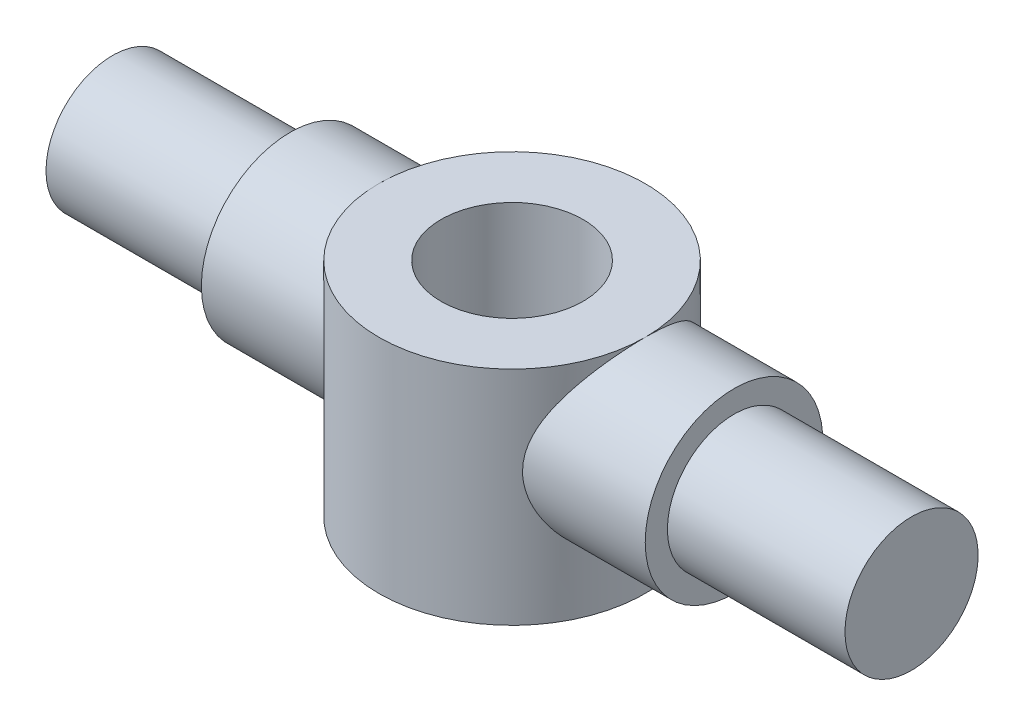
ISO-10303-21;
HEADER;
FILE_DESCRIPTION(('STEP AP214'),'2;1');
FILE_NAME('part.step','',(''),(''),'','','');
FILE_SCHEMA(('AUTOMOTIVE_DESIGN { 1 0 10303 214 1 1 1 1 }'));
ENDSEC;
DATA;
#1=APPLICATION_CONTEXT('core data for automotive mechanical design processes');
#2=APPLICATION_PROTOCOL_DEFINITION('international standard','automotive_design',2000,#1);
#3=PRODUCT_CONTEXT('',#1,'mechanical');
#4=PRODUCT('Part','Part','',(#3));
#5=PRODUCT_RELATED_PRODUCT_CATEGORY('part','',(#4));
#6=PRODUCT_DEFINITION_FORMATION('','',#4);
#7=PRODUCT_DEFINITION_CONTEXT('part definition',#1,'design');
#8=PRODUCT_DEFINITION('design','',#6,#7);
#9=PRODUCT_DEFINITION_SHAPE('','',#8);
#10=(LENGTH_UNIT() NAMED_UNIT(*) SI_UNIT(.MILLI.,.METRE.));
#11=(NAMED_UNIT(*) PLANE_ANGLE_UNIT() SI_UNIT($,.RADIAN.));
#12=(NAMED_UNIT(*) SI_UNIT($,.STERADIAN.) SOLID_ANGLE_UNIT());
#13=UNCERTAINTY_MEASURE_WITH_UNIT(LENGTH_MEASURE(1.E-05),#10,'distance_accuracy_value','');
#14=(GEOMETRIC_REPRESENTATION_CONTEXT(3) GLOBAL_UNCERTAINTY_ASSIGNED_CONTEXT((#13)) GLOBAL_UNIT_ASSIGNED_CONTEXT((#10,
#11,#12)) REPRESENTATION_CONTEXT('',''));
#15=CARTESIAN_POINT('',(0.,0.,0.));
#16=DIRECTION('',(0.,0.,1.));
#17=DIRECTION('',(1.,0.,0.));
#18=AXIS2_PLACEMENT_3D('',#15,#16,#17);
#19=CARTESIAN_POINT('',(0.,-3.,0.));
#20=DIRECTION('',(0.,1.,0.));
#21=DIRECTION('',(0.,0.,1.));
#22=AXIS2_PLACEMENT_3D('',#19,#20,#21);
#23=CYLINDRICAL_SURFACE('',#22,3.);
#24=CARTESIAN_POINT('',(0.,-3.,0.));
#25=DIRECTION('',(0.,1.,0.));
#26=DIRECTION('',(0.,0.,1.));
#27=AXIS2_PLACEMENT_3D('',#24,#25,#26);
#28=CIRCLE('',#27,3.);
#29=CARTESIAN_POINT('',(0.,-3.,3.));
#30=VERTEX_POINT('',#29);
#31=EDGE_CURVE('E108',#30,#30,#28,.T.);
#32=ORIENTED_EDGE('',*,*,#31,.T.);
#33=EDGE_LOOP('',(#32));
#34=FACE_BOUND('',#33,.T.);
#35=CARTESIAN_POINT('',(0.,2.,0.));
#36=DIRECTION('',(0.,1.,0.));
#37=DIRECTION('',(0.,0.,1.));
#38=AXIS2_PLACEMENT_3D('',#35,#36,#37);
#39=CIRCLE('',#38,3.);
#40=CARTESIAN_POINT('',(3.,2.,0.));
#41=VERTEX_POINT('',#40);
#42=CARTESIAN_POINT('',(-3.,2.,0.));
#43=VERTEX_POINT('',#42);
#44=EDGE_CURVE('E50',#41,#43,#39,.T.);
#45=ORIENTED_EDGE('',*,*,#44,.F.);
#46=CARTESIAN_POINT('',(2.23606797749979,0.,2.));
#47=CARTESIAN_POINT('',(2.23607753462817,0.0976283108686206,1.99999453997731));
#48=CARTESIAN_POINT('',(2.24258071047442,0.195290753708801,1.99278992503664));
#49=CARTESIAN_POINT('',(2.26731972501617,0.387119911650814,1.96458268317731));
#50=CARTESIAN_POINT('',(2.2855766081271,0.481280035529566,1.94355530587862));
#51=CARTESIAN_POINT('',(2.3305658582557,0.662735441877684,1.88935861676632));
#52=CARTESIAN_POINT('',(2.35721561794602,0.750087696737658,1.85630718014214));
#53=CARTESIAN_POINT('',(2.41584094681825,0.917865832346664,1.77934008393538));
#54=CARTESIAN_POINT('',(2.44781762158831,0.998290269976474,1.73542216812163));
#55=CARTESIAN_POINT('',(2.51946072932026,1.16364688761691,1.63002410007714));
#56=CARTESIAN_POINT('',(2.55954936090364,1.2473321177172,1.56687435451732));
#57=CARTESIAN_POINT('',(2.63944827308083,1.40400270887428,1.4281921974068));
#58=CARTESIAN_POINT('',(2.67925824297985,1.47697752165853,1.3526477317708));
#59=CARTESIAN_POINT('',(2.76088818523747,1.62064365878166,1.17815690494295));
#60=CARTESIAN_POINT('',(2.80216785846923,1.68948251177567,1.07740643965819));
#61=CARTESIAN_POINT('',(2.87558484482764,1.80864209549007,0.862470964212232));
#62=CARTESIAN_POINT('',(2.90773236231037,1.85898351403119,0.748301152321703));
#63=CARTESIAN_POINT('',(2.95599907464725,1.93355640101745,0.523249073480002));
#64=CARTESIAN_POINT('',(2.97351175615867,1.96008334449556,0.413434725181415));
#65=CARTESIAN_POINT('',(2.99609745461921,1.99418448928365,0.189695448729861));
#66=CARTESIAN_POINT('',(3.00118613762359,2.00178255922544,0.0757758812858244));
#67=CARTESIAN_POINT('',(2.99855361722953,1.99782755005095,-0.13414705023233));
#68=CARTESIAN_POINT('',(2.99266264910127,1.98901094868294,-0.230240638008753));
#69=CARTESIAN_POINT('',(2.9720818279002,1.95790894864109,-0.419238633271016));
#70=CARTESIAN_POINT('',(2.95739133313102,1.93562256769646,-0.512142807649724));
#71=CARTESIAN_POINT('',(2.92052091703736,1.87880431520542,-0.692077937671169));
#72=CARTESIAN_POINT('',(2.89837077982679,1.84432111480144,-0.779130623845961));
#73=CARTESIAN_POINT('',(2.84821104476287,1.76444635704718,-0.946209150653556));
#74=CARTESIAN_POINT('',(2.82020037745161,1.71905280849849,-1.0262337049694));
#75=CARTESIAN_POINT('',(2.75618058450702,1.61202126254011,-1.18828429196344));
#76=CARTESIAN_POINT('',(2.71960408792025,1.54903247664721,-1.26919148099708));
#77=CARTESIAN_POINT('',(2.64400601826998,1.41210132051968,-1.41998807498305));
#78=CARTESIAN_POINT('',(2.60498072815232,1.33814205406619,-1.48986013519457));
#79=CARTESIAN_POINT('',(2.52150044944152,1.16803678978671,-1.62772235326165));
#80=CARTESIAN_POINT('',(2.47714320008932,1.07022892028551,-1.69373593126354));
#81=CARTESIAN_POINT('',(2.39475610831095,0.862490160779287,-1.80834874945482));
#82=CARTESIAN_POINT('',(2.3567157153489,0.752580005586102,-1.85697718654898));
#83=CARTESIAN_POINT('',(2.30262870306889,0.555280937926897,-1.92332724567776));
#84=CARTESIAN_POINT('',(2.28340364577668,0.470406629943126,-1.94590791747533));
#85=CARTESIAN_POINT('',(2.25409039789612,0.296960510183162,-1.97979555580014));
#86=CARTESIAN_POINT('',(2.24398636782354,0.208395388827381,-1.99112206964395));
#87=CARTESIAN_POINT('',(2.23447556987372,0.0295570135585055,-2.00179400148877));
#88=CARTESIAN_POINT('',(2.2351153386647,-0.0607219785201236,-2.00108729753098));
#89=CARTESIAN_POINT('',(2.24709880368953,-0.239683833955044,-1.98761629716365));
#90=CARTESIAN_POINT('',(2.25845117648851,-0.328365344107385,-1.97484222690381));
#91=CARTESIAN_POINT('',(2.28927977500747,-0.497389417549839,-1.93899811187046));
#92=CARTESIAN_POINT('',(2.30833187069749,-0.577927709002577,-1.91646174529973));
#93=CARTESIAN_POINT('',(2.3522995853365,-0.734126236050298,-1.86223041628513));
#94=CARTESIAN_POINT('',(2.3772171729463,-0.809784822963013,-1.83053237805351));
#95=CARTESIAN_POINT('',(2.43611483596194,-0.97020200384752,-1.75163346599563));
#96=CARTESIAN_POINT('',(2.47091081434317,-1.05375681154269,-1.70260028818246));
#97=CARTESIAN_POINT('',(2.54262514806634,-1.21241680261729,-1.59352731501438));
#98=CARTESIAN_POINT('',(2.57954604947543,-1.28751151674245,-1.53347411883827));
#99=CARTESIAN_POINT('',(2.66075678321007,-1.44396234746754,-1.38876657712435));
#100=CARTESIAN_POINT('',(2.70489452138573,-1.52310284824832,-1.30160386514207));
#101=CARTESIAN_POINT('',(2.78775581841638,-1.66581668294029,-1.11309948866219));
#102=CARTESIAN_POINT('',(2.82648414789457,-1.72940377125673,-1.011770477457));
#103=CARTESIAN_POINT('',(2.88790821242222,-1.82789173891759,-0.817487474821796));
#104=CARTESIAN_POINT('',(2.91225458111008,-1.86595650444037,-0.72666236488632));
#105=CARTESIAN_POINT('',(2.95278707867041,-1.92860719432044,-0.538757079020514));
#106=CARTESIAN_POINT('',(2.96898009871993,-1.95320450285977,-0.441682263858768));
#107=CARTESIAN_POINT('',(2.99178364026746,-1.98769696383875,-0.243369392303442));
#108=CARTESIAN_POINT('',(2.99835150856533,-1.99752667950668,-0.142114836924317));
#109=CARTESIAN_POINT('',(3.00109821029056,-2.0016478514171,0.0608555465807331));
#110=CARTESIAN_POINT('',(2.99727800938902,-1.99594075195618,0.162571330953449));
#111=CARTESIAN_POINT('',(2.98029555977324,-1.9703405109953,0.355757532528107));
#112=CARTESIAN_POINT('',(2.96783277209856,-1.95150901513819,0.447435143070531));
#113=CARTESIAN_POINT('',(2.93536106206933,-1.9017619905691,0.626018422997062));
#114=CARTESIAN_POINT('',(2.91535096747103,-1.87084458465274,0.712923348686891));
#115=CARTESIAN_POINT('',(2.86791765486194,-1.79606129511597,0.885147296608352));
#116=CARTESIAN_POINT('',(2.84013248946338,-1.75154969250492,0.970083589200266));
#117=CARTESIAN_POINT('',(2.77975408235472,-1.65184935537401,1.13155266268318));
#118=CARTESIAN_POINT('',(2.74715796645263,-1.596654232048,1.20808037205002));
#119=CARTESIAN_POINT('',(2.67392931472394,-1.46737109766369,1.36329422201402));
#120=CARTESIAN_POINT('',(2.6328391387737,-1.39167697632596,1.44042679526091));
#121=CARTESIAN_POINT('',(2.55053357649486,-1.22888645845416,1.58160022281596));
#122=CARTESIAN_POINT('',(2.50931811970154,-1.14178161116591,1.64563128323923));
#123=CARTESIAN_POINT('',(2.43384213590298,-0.964132409244706,1.75513253518411));
#124=CARTESIAN_POINT('',(2.39929086741904,-0.874358190049655,1.8016464689721));
#125=CARTESIAN_POINT('',(2.33747501591023,-0.686715551006839,1.88115802340272));
#126=CARTESIAN_POINT('',(2.31019631295305,-0.588863306137845,1.91418190281333));
#127=CARTESIAN_POINT('',(2.27191051929539,-0.40922853157545,1.95936262470908));
#128=CARTESIAN_POINT('',(2.25863695410151,-0.328691763209701,1.97452228373248));
#129=CARTESIAN_POINT('',(2.24071519216009,-0.165443599495462,1.99483915818926));
#130=CARTESIAN_POINT('',(2.23605987841475,-0.0827340557394216,2.00000462703715));
#131=CARTESIAN_POINT('',(2.23606797749979,0.,2.));
#132=B_SPLINE_CURVE_WITH_KNOTS('',3,(#46,#47,#48,#49,#50,#51,#52,#53,#54,#55,#56,#57,#58,#59,
#60,#61,#62,#63,#64,#65,#66,#67,#68,#69,#70,#71,#72,#73,#74,#75,#76,#77,#78,#79,#80,#81,#82,#83,
#84,#85,#86,#87,#88,#89,#90,#91,#92,#93,#94,#95,#96,#97,#98,#99,#100,#101,#102,#103,#104,#105,
#106,#107,#108,#109,#110,#111,#112,#113,#114,#115,#116,#117,#118,#119,#120,#121,#122,#123,#124,
#125,#126,#127,#128,#129,#130,#131),.UNSPECIFIED.,.T.,.F.,(4,2,2,2,2,2,2,2,2,2,2,2,2,2,2,2,2,2,
2,2,2,2,2,2,2,2,2,2,2,2,2,2,2,2,2,2,2,2,2,2,2,2,4),(0.,0.292506930722153,0.585539042259288,
0.875772651216274,1.16606657266549,1.50154677068638,1.83735518436275,2.22167031006289,
2.6055542938858,2.9463748206358,3.28676536688298,3.57539534955742,3.86404638283746,
4.15155831973191,4.43912276903,4.76447525946635,5.09033414796638,5.46678703504944,
5.84260469743948,6.11126090401324,6.37944966235486,6.64880037638036,6.91836943570598,
7.17476451706936,7.43124577644957,7.73899230052352,8.04711556801509,8.42254684520963,
8.7976449057258,9.10070580611698,9.40351012888472,9.70765229266165,10.0117661844615,
10.2937678224973,10.5758132789284,10.874178629859,11.1727229593109,11.5182220628451,
11.863978504186,12.1833412579672,12.5020793664923,12.7501661630426,12.9980479966543),.UNSPECIFIED.);
#133=EDGE_CURVE('E55',#41,#41,#132,.T.);
#134=ORIENTED_EDGE('',*,*,#133,.T.);
#135=EDGE_CURVE('E62',#43,#41,#39,.T.);
#136=ORIENTED_EDGE('',*,*,#135,.F.);
#137=CARTESIAN_POINT('',(-2.23606797749979,0.,2.));
#138=CARTESIAN_POINT('',(-2.23607753462817,-0.0976283108686206,1.99999453997731));
#139=CARTESIAN_POINT('',(-2.24258071047442,-0.195290753708801,1.99278992503664));
#140=CARTESIAN_POINT('',(-2.26731972501617,-0.387119911650814,1.96458268317731));
#141=CARTESIAN_POINT('',(-2.2855766081271,-0.481280035529566,1.94355530587862));
#142=CARTESIAN_POINT('',(-2.3305658582557,-0.662735441877684,1.88935861676632));
#143=CARTESIAN_POINT('',(-2.35721561794602,-0.750087696737658,1.85630718014214));
#144=CARTESIAN_POINT('',(-2.41584094681825,-0.917865832346664,1.77934008393538));
#145=CARTESIAN_POINT('',(-2.44781762158831,-0.998290269976474,1.73542216812163));
#146=CARTESIAN_POINT('',(-2.51946072932026,-1.16364688761691,1.63002410007714));
#147=CARTESIAN_POINT('',(-2.55954936090364,-1.2473321177172,1.56687435451732));
#148=CARTESIAN_POINT('',(-2.63944827308083,-1.40400270887428,1.4281921974068));
#149=CARTESIAN_POINT('',(-2.67925824297985,-1.47697752165853,1.3526477317708));
#150=CARTESIAN_POINT('',(-2.76088818523747,-1.62064365878166,1.17815690494295));
#151=CARTESIAN_POINT('',(-2.80216785846923,-1.68948251177567,1.07740643965819));
#152=CARTESIAN_POINT('',(-2.87558484482764,-1.80864209549007,0.862470964212232));
#153=CARTESIAN_POINT('',(-2.90773236231037,-1.85898351403119,0.748301152321703));
#154=CARTESIAN_POINT('',(-2.95599907464725,-1.93355640101745,0.523249073480002));
#155=CARTESIAN_POINT('',(-2.97351175615867,-1.96008334449556,0.413434725181415));
#156=CARTESIAN_POINT('',(-2.99609745461921,-1.99418448928365,0.189695448729861));
#157=CARTESIAN_POINT('',(-3.00118613762359,-2.00178255922544,0.0757758812858244));
#158=CARTESIAN_POINT('',(-2.99855361722953,-1.99782755005095,-0.13414705023233));
#159=CARTESIAN_POINT('',(-2.99266264910127,-1.98901094868294,-0.230240638008753));
#160=CARTESIAN_POINT('',(-2.9720818279002,-1.95790894864109,-0.419238633271016));
#161=CARTESIAN_POINT('',(-2.95739133313102,-1.93562256769646,-0.512142807649724));
#162=CARTESIAN_POINT('',(-2.92052091703736,-1.87880431520542,-0.692077937671169));
#163=CARTESIAN_POINT('',(-2.89837077982679,-1.84432111480144,-0.779130623845961));
#164=CARTESIAN_POINT('',(-2.84821104476287,-1.76444635704718,-0.946209150653556));
#165=CARTESIAN_POINT('',(-2.82020037745161,-1.71905280849849,-1.0262337049694));
#166=CARTESIAN_POINT('',(-2.75618058450702,-1.61202126254011,-1.18828429196344));
#167=CARTESIAN_POINT('',(-2.71960408792025,-1.54903247664721,-1.26919148099708));
#168=CARTESIAN_POINT('',(-2.64400601826998,-1.41210132051968,-1.41998807498305));
#169=CARTESIAN_POINT('',(-2.60498072815232,-1.33814205406619,-1.48986013519457));
#170=CARTESIAN_POINT('',(-2.52150044944152,-1.16803678978671,-1.62772235326165));
#171=CARTESIAN_POINT('',(-2.47714320008932,-1.07022892028551,-1.69373593126354));
#172=CARTESIAN_POINT('',(-2.39475610831095,-0.862490160779287,-1.80834874945482));
#173=CARTESIAN_POINT('',(-2.3567157153489,-0.752580005586102,-1.85697718654898));
#174=CARTESIAN_POINT('',(-2.30262870306889,-0.555280937926897,-1.92332724567776));
#175=CARTESIAN_POINT('',(-2.28340364577668,-0.470406629943126,-1.94590791747533));
#176=CARTESIAN_POINT('',(-2.25409039789612,-0.296960510183162,-1.97979555580014));
#177=CARTESIAN_POINT('',(-2.24398636782354,-0.208395388827381,-1.99112206964395));
#178=CARTESIAN_POINT('',(-2.23447556987372,-0.0295570135585055,-2.00179400148877));
#179=CARTESIAN_POINT('',(-2.2351153386647,0.0607219785201236,-2.00108729753098));
#180=CARTESIAN_POINT('',(-2.24709880368953,0.239683833955044,-1.98761629716365));
#181=CARTESIAN_POINT('',(-2.25845117648851,0.328365344107385,-1.97484222690381));
#182=CARTESIAN_POINT('',(-2.28927977500747,0.497389417549839,-1.93899811187046));
#183=CARTESIAN_POINT('',(-2.30833187069749,0.577927709002577,-1.91646174529973));
#184=CARTESIAN_POINT('',(-2.3522995853365,0.734126236050298,-1.86223041628513));
#185=CARTESIAN_POINT('',(-2.3772171729463,0.809784822963013,-1.83053237805351));
#186=CARTESIAN_POINT('',(-2.43611483596194,0.97020200384752,-1.75163346599563));
#187=CARTESIAN_POINT('',(-2.47091081434317,1.05375681154269,-1.70260028818246));
#188=CARTESIAN_POINT('',(-2.54262514806634,1.21241680261729,-1.59352731501438));
#189=CARTESIAN_POINT('',(-2.57954604947543,1.28751151674245,-1.53347411883827));
#190=CARTESIAN_POINT('',(-2.66075678321007,1.44396234746754,-1.38876657712435));
#191=CARTESIAN_POINT('',(-2.70489452138573,1.52310284824832,-1.30160386514207));
#192=CARTESIAN_POINT('',(-2.78775581841638,1.66581668294029,-1.11309948866219));
#193=CARTESIAN_POINT('',(-2.82648414789457,1.72940377125673,-1.011770477457));
#194=CARTESIAN_POINT('',(-2.88790821242222,1.82789173891759,-0.817487474821796));
#195=CARTESIAN_POINT('',(-2.91225458111008,1.86595650444037,-0.72666236488632));
#196=CARTESIAN_POINT('',(-2.95278707867041,1.92860719432044,-0.538757079020514));
#197=CARTESIAN_POINT('',(-2.96898009871993,1.95320450285977,-0.441682263858768));
#198=CARTESIAN_POINT('',(-2.99178364026746,1.98769696383875,-0.243369392303442));
#199=CARTESIAN_POINT('',(-2.99835150856533,1.99752667950668,-0.142114836924317));
#200=CARTESIAN_POINT('',(-3.00109821029056,2.0016478514171,0.0608555465807331));
#201=CARTESIAN_POINT('',(-2.99727800938902,1.99594075195618,0.162571330953449));
#202=CARTESIAN_POINT('',(-2.98029555977324,1.9703405109953,0.355757532528107));
#203=CARTESIAN_POINT('',(-2.96783277209856,1.95150901513819,0.447435143070531));
#204=CARTESIAN_POINT('',(-2.93536106206933,1.9017619905691,0.626018422997062));
#205=CARTESIAN_POINT('',(-2.91535096747103,1.87084458465274,0.712923348686891));
#206=CARTESIAN_POINT('',(-2.86791765486194,1.79606129511597,0.885147296608352));
#207=CARTESIAN_POINT('',(-2.84013248946338,1.75154969250492,0.970083589200266));
#208=CARTESIAN_POINT('',(-2.77975408235472,1.65184935537401,1.13155266268318));
#209=CARTESIAN_POINT('',(-2.74715796645263,1.596654232048,1.20808037205002));
#210=CARTESIAN_POINT('',(-2.67392931472394,1.46737109766369,1.36329422201402));
#211=CARTESIAN_POINT('',(-2.6328391387737,1.39167697632596,1.44042679526091));
#212=CARTESIAN_POINT('',(-2.55053357649486,1.22888645845416,1.58160022281596));
#213=CARTESIAN_POINT('',(-2.50931811970154,1.14178161116591,1.64563128323923));
#214=CARTESIAN_POINT('',(-2.43384213590298,0.964132409244706,1.75513253518411));
#215=CARTESIAN_POINT('',(-2.39929086741904,0.874358190049655,1.8016464689721));
#216=CARTESIAN_POINT('',(-2.33747501591023,0.686715551006839,1.88115802340272));
#217=CARTESIAN_POINT('',(-2.31019631295305,0.588863306137845,1.91418190281333));
#218=CARTESIAN_POINT('',(-2.27191051929539,0.40922853157545,1.95936262470908));
#219=CARTESIAN_POINT('',(-2.25863695410151,0.328691763209701,1.97452228373248));
#220=CARTESIAN_POINT('',(-2.24071519216009,0.165443599495462,1.99483915818926));
#221=CARTESIAN_POINT('',(-2.23605987841475,0.0827340557394216,2.00000462703715));
#222=CARTESIAN_POINT('',(-2.23606797749979,0.,2.));
#223=B_SPLINE_CURVE_WITH_KNOTS('',3,(#137,#138,#139,#140,#141,#142,#143,#144,#145,#146,#147,
#148,#149,#150,#151,#152,#153,#154,#155,#156,#157,#158,#159,#160,#161,#162,#163,#164,#165,#166,
#167,#168,#169,#170,#171,#172,#173,#174,#175,#176,#177,#178,#179,#180,#181,#182,#183,#184,#185,
#186,#187,#188,#189,#190,#191,#192,#193,#194,#195,#196,#197,#198,#199,#200,#201,#202,#203,#204,
#205,#206,#207,#208,#209,#210,#211,#212,#213,#214,#215,#216,#217,#218,#219,#220,#221,#222),
.UNSPECIFIED.,.T.,.F.,(4,2,2,2,2,2,2,2,2,2,2,2,2,2,2,2,2,2,2,2,2,2,2,2,2,2,2,2,2,2,2,2,2,2,2,2,
2,2,2,2,2,2,4),(0.,0.292506930722153,0.585539042259288,0.875772651216274,1.16606657266549,
1.50154677068638,1.83735518436275,2.22167031006289,2.6055542938858,2.9463748206358,
3.28676536688298,3.57539534955742,3.86404638283746,4.15155831973191,4.43912276903,
4.76447525946635,5.09033414796638,5.46678703504944,5.84260469743948,6.11126090401324,
6.37944966235486,6.64880037638036,6.91836943570598,7.17476451706936,7.43124577644957,
7.73899230052352,8.04711556801509,8.42254684520963,8.7976449057258,9.10070580611698,
9.40351012888472,9.70765229266165,10.0117661844615,10.2937678224973,10.5758132789284,
10.874178629859,11.1727229593109,11.5182220628451,11.863978504186,12.1833412579672,
12.5020793664923,12.7501661630426,12.9980479966543),.UNSPECIFIED.);
#224=EDGE_CURVE('E110',#43,#43,#223,.T.);
#225=ORIENTED_EDGE('',*,*,#224,.T.);
#226=EDGE_LOOP('',(#45,#134,#136,#225));
#227=FACE_BOUND('',#226,.T.);
#228=ADVANCED_FACE('F35',(#34,#227),#23,.T.);
#229=CARTESIAN_POINT('',(-9.,0.,0.));
#230=DIRECTION('',(-1.,0.,0.));
#231=DIRECTION('',(0.,0.,1.));
#232=AXIS2_PLACEMENT_3D('',#229,#230,#231);
#233=CYLINDRICAL_SURFACE('',#232,2.);
#234=ORIENTED_EDGE('',*,*,#224,.F.);
#235=EDGE_LOOP('',(#234));
#236=FACE_BOUND('',#235,.T.);
#237=CARTESIAN_POINT('',(-5.,0.,0.));
#238=DIRECTION('',(-1.,0.,0.));
#239=DIRECTION('',(0.,0.,1.));
#240=AXIS2_PLACEMENT_3D('',#237,#238,#239);
#241=CIRCLE('',#240,2.);
#242=CARTESIAN_POINT('',(-5.,0.,2.));
#243=VERTEX_POINT('',#242);
#244=EDGE_CURVE('E123',#243,#243,#241,.T.);
#245=ORIENTED_EDGE('',*,*,#244,.F.);
#246=EDGE_LOOP('',(#245));
#247=FACE_BOUND('',#246,.T.);
#248=ADVANCED_FACE('F37',(#236,#247),#233,.T.);
#249=CARTESIAN_POINT('',(-9.,0.,1.));
#250=DIRECTION('',(1.,0.,0.));
#251=DIRECTION('',(0.,0.,-1.));
#252=AXIS2_PLACEMENT_3D('',#249,#250,#251);
#253=PLANE('',#252);
#254=CARTESIAN_POINT('',(-9.,0.,0.));
#255=DIRECTION('',(-1.,0.,0.));
#256=DIRECTION('',(0.,0.,1.));
#257=AXIS2_PLACEMENT_3D('',#254,#255,#256);
#258=CIRCLE('',#257,1.5);
#259=CARTESIAN_POINT('',(-9.,0.,1.5));
#260=VERTEX_POINT('',#259);
#261=EDGE_CURVE('E11',#260,#260,#258,.T.);
#262=ORIENTED_EDGE('',*,*,#261,.T.);
#263=EDGE_LOOP('',(#262));
#264=FACE_BOUND('',#263,.T.);
#265=ADVANCED_FACE('F104',(#264),#253,.F.);
#266=CARTESIAN_POINT('',(-9.,0.,0.));
#267=DIRECTION('',(-1.,0.,0.));
#268=DIRECTION('',(0.,0.,1.));
#269=AXIS2_PLACEMENT_3D('',#266,#267,#268);
#270=CYLINDRICAL_SURFACE('',#269,1.5);
#271=CARTESIAN_POINT('',(-5.,0.,0.));
#272=DIRECTION('',(-1.,0.,0.));
#273=DIRECTION('',(0.,0.,1.));
#274=AXIS2_PLACEMENT_3D('',#271,#272,#273);
#275=CIRCLE('',#274,1.5);
#276=CARTESIAN_POINT('',(-5.,0.,1.5));
#277=VERTEX_POINT('',#276);
#278=EDGE_CURVE('E44',#277,#277,#275,.T.);
#279=ORIENTED_EDGE('',*,*,#278,.T.);
#280=EDGE_LOOP('',(#279));
#281=FACE_BOUND('',#280,.T.);
#282=ORIENTED_EDGE('',*,*,#261,.F.);
#283=EDGE_LOOP('',(#282));
#284=FACE_BOUND('',#283,.T.);
#285=ADVANCED_FACE('F95',(#281,#284),#270,.T.);
#286=CARTESIAN_POINT('',(-5.,0.,1.));
#287=DIRECTION('',(1.,0.,0.));
#288=DIRECTION('',(0.,0.,-1.));
#289=AXIS2_PLACEMENT_3D('',#286,#287,#288);
#290=PLANE('',#289);
#291=ORIENTED_EDGE('',*,*,#278,.F.);
#292=EDGE_LOOP('',(#291));
#293=FACE_BOUND('',#292,.T.);
#294=ORIENTED_EDGE('',*,*,#244,.T.);
#295=EDGE_LOOP('',(#294));
#296=FACE_BOUND('',#295,.T.);
#297=ADVANCED_FACE('F90',(#293,#296),#290,.F.);
#298=CARTESIAN_POINT('',(0.,-3.,0.));
#299=DIRECTION('',(0.,1.,0.));
#300=DIRECTION('',(0.,0.,1.));
#301=AXIS2_PLACEMENT_3D('',#298,#299,#300);
#302=CYLINDRICAL_SURFACE('',#301,1.6);
#303=CARTESIAN_POINT('',(0.,-3.,0.));
#304=DIRECTION('',(0.,1.,0.));
#305=DIRECTION('',(0.,0.,1.));
#306=AXIS2_PLACEMENT_3D('',#303,#304,#305);
#307=CIRCLE('',#306,1.6);
#308=CARTESIAN_POINT('',(0.,-3.,1.6));
#309=VERTEX_POINT('',#308);
#310=EDGE_CURVE('E115',#309,#309,#307,.T.);
#311=ORIENTED_EDGE('',*,*,#310,.F.);
#312=EDGE_LOOP('',(#311));
#313=FACE_BOUND('',#312,.T.);
#314=CARTESIAN_POINT('',(0.,2.,0.));
#315=DIRECTION('',(0.,1.,0.));
#316=DIRECTION('',(0.,0.,1.));
#317=AXIS2_PLACEMENT_3D('',#314,#315,#316);
#318=CIRCLE('',#317,1.6);
#319=CARTESIAN_POINT('',(0.,2.,1.6));
#320=VERTEX_POINT('',#319);
#321=EDGE_CURVE('E112',#320,#320,#318,.T.);
#322=ORIENTED_EDGE('',*,*,#321,.T.);
#323=EDGE_LOOP('',(#322));
#324=FACE_BOUND('',#323,.T.);
#325=ADVANCED_FACE('F87',(#313,#324),#302,.F.);
#326=CARTESIAN_POINT('',(-14.2282946785896,-3.,1.));
#327=DIRECTION('',(0.,1.,0.));
#328=DIRECTION('',(0.,0.,1.));
#329=AXIS2_PLACEMENT_3D('',#326,#327,#328);
#330=PLANE('',#329);
#331=ORIENTED_EDGE('',*,*,#31,.F.);
#332=EDGE_LOOP('',(#331));
#333=FACE_BOUND('',#332,.T.);
#334=ORIENTED_EDGE('',*,*,#310,.T.);
#335=EDGE_LOOP('',(#334));
#336=FACE_BOUND('',#335,.T.);
#337=ADVANCED_FACE('F85',(#333,#336),#330,.F.);
#338=CARTESIAN_POINT('',(-14.2282946785896,2.,1.));
#339=DIRECTION('',(0.,1.,0.));
#340=DIRECTION('',(0.,0.,1.));
#341=AXIS2_PLACEMENT_3D('',#338,#339,#340);
#342=PLANE('',#341);
#343=ORIENTED_EDGE('',*,*,#135,.T.);
#344=ORIENTED_EDGE('',*,*,#44,.T.);
#345=EDGE_LOOP('',(#343,#344));
#346=FACE_BOUND('',#345,.T.);
#347=ORIENTED_EDGE('',*,*,#321,.F.);
#348=EDGE_LOOP('',(#347));
#349=FACE_BOUND('',#348,.T.);
#350=ADVANCED_FACE('F81',(#346,#349),#342,.T.);
#351=CARTESIAN_POINT('',(-9.,0.,0.));
#352=DIRECTION('',(-1.,0.,0.));
#353=DIRECTION('',(0.,0.,1.));
#354=AXIS2_PLACEMENT_3D('',#351,#352,#353);
#355=CYLINDRICAL_SURFACE('',#354,2.);
#356=ORIENTED_EDGE('',*,*,#133,.F.);
#357=EDGE_LOOP('',(#356));
#358=FACE_BOUND('',#357,.T.);
#359=CARTESIAN_POINT('',(5.,0.,0.));
#360=DIRECTION('',(-1.,0.,0.));
#361=DIRECTION('',(0.,0.,1.));
#362=AXIS2_PLACEMENT_3D('',#359,#360,#361);
#363=CIRCLE('',#362,2.);
#364=CARTESIAN_POINT('',(5.,0.,2.));
#365=VERTEX_POINT('',#364);
#366=EDGE_CURVE('E60',#365,#365,#363,.T.);
#367=ORIENTED_EDGE('',*,*,#366,.T.);
#368=EDGE_LOOP('',(#367));
#369=FACE_BOUND('',#368,.T.);
#370=ADVANCED_FACE('F56',(#358,#369),#355,.T.);
#371=CARTESIAN_POINT('',(5.,0.,1.));
#372=DIRECTION('',(1.,0.,0.));
#373=DIRECTION('',(0.,0.,-1.));
#374=AXIS2_PLACEMENT_3D('',#371,#372,#373);
#375=PLANE('',#374);
#376=CARTESIAN_POINT('',(5.,0.,0.));
#377=DIRECTION('',(-1.,0.,0.));
#378=DIRECTION('',(0.,0.,1.));
#379=AXIS2_PLACEMENT_3D('',#376,#377,#378);
#380=CIRCLE('',#379,1.5);
#381=CARTESIAN_POINT('',(5.,0.,1.5));
#382=VERTEX_POINT('',#381);
#383=EDGE_CURVE('E65',#382,#382,#380,.T.);
#384=ORIENTED_EDGE('',*,*,#383,.T.);
#385=EDGE_LOOP('',(#384));
#386=FACE_BOUND('',#385,.T.);
#387=ORIENTED_EDGE('',*,*,#366,.F.);
#388=EDGE_LOOP('',(#387));
#389=FACE_BOUND('',#388,.T.);
#390=ADVANCED_FACE('F80',(#386,#389),#375,.T.);
#391=CARTESIAN_POINT('',(-9.,0.,0.));
#392=DIRECTION('',(-1.,0.,0.));
#393=DIRECTION('',(0.,0.,1.));
#394=AXIS2_PLACEMENT_3D('',#391,#392,#393);
#395=CYLINDRICAL_SURFACE('',#394,1.5);
#396=ORIENTED_EDGE('',*,*,#383,.F.);
#397=EDGE_LOOP('',(#396));
#398=FACE_BOUND('',#397,.T.);
#399=CARTESIAN_POINT('',(9.,0.,0.));
#400=DIRECTION('',(-1.,0.,0.));
#401=DIRECTION('',(0.,0.,1.));
#402=AXIS2_PLACEMENT_3D('',#399,#400,#401);
#403=CIRCLE('',#402,1.5);
#404=CARTESIAN_POINT('',(9.,0.,1.5));
#405=VERTEX_POINT('',#404);
#406=EDGE_CURVE('E222',#405,#405,#403,.T.);
#407=ORIENTED_EDGE('',*,*,#406,.T.);
#408=EDGE_LOOP('',(#407));
#409=FACE_BOUND('',#408,.T.);
#410=ADVANCED_FACE('F193',(#398,#409),#395,.T.);
#411=CARTESIAN_POINT('',(9.,0.,1.));
#412=DIRECTION('',(-1.,0.,0.));
#413=DIRECTION('',(0.,0.,1.));
#414=AXIS2_PLACEMENT_3D('',#411,#412,#413);
#415=PLANE('',#414);
#416=ORIENTED_EDGE('',*,*,#406,.F.);
#417=EDGE_LOOP('',(#416));
#418=FACE_BOUND('',#417,.T.);
#419=ADVANCED_FACE('F202',(#418),#415,.F.);
#420=CLOSED_SHELL('',(#228,#248,#265,#285,#297,#325,#337,#350,#370,#390,#410,#419));
#421=MANIFOLD_SOLID_BREP('B2',#420);
#422=ADVANCED_BREP_SHAPE_REPRESENTATION('',(#18,#421),#14);
#423=SHAPE_DEFINITION_REPRESENTATION(#9,#422);
ENDSEC;
END-ISO-10303-21;
